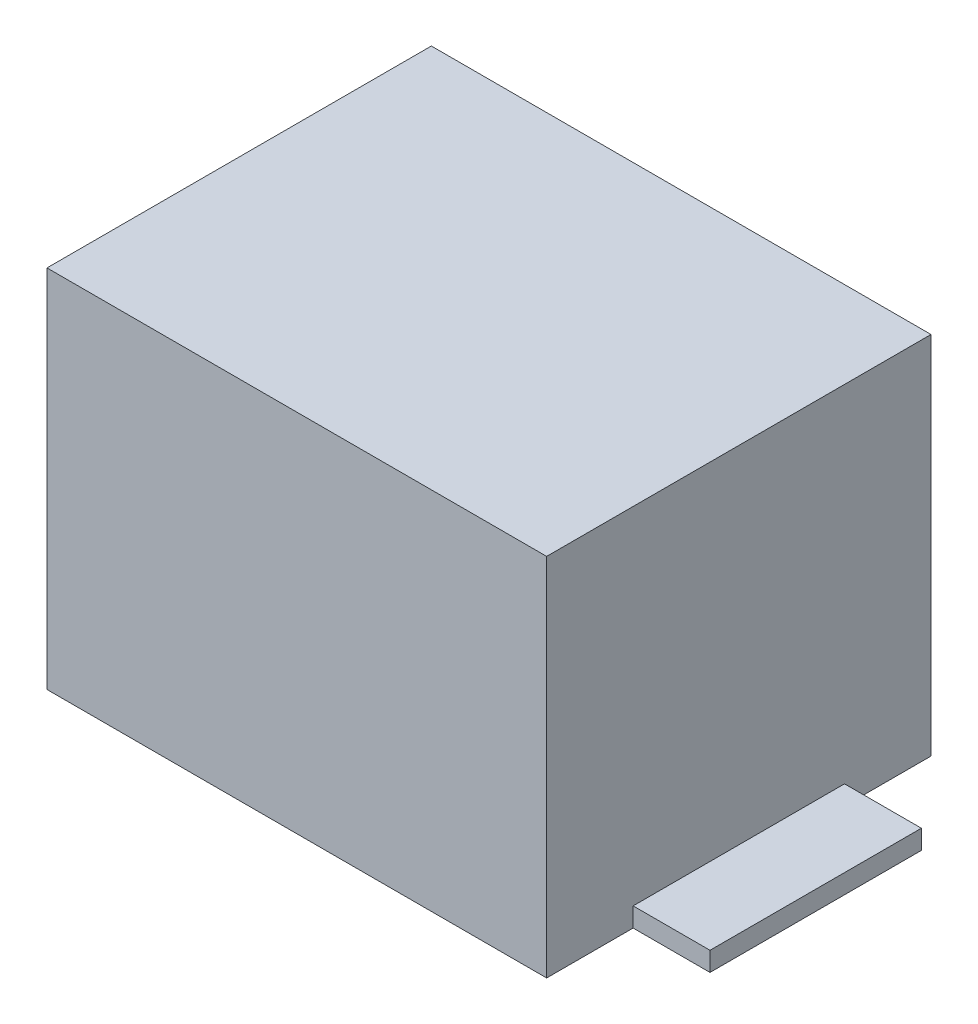
ISO-10303-21;
HEADER;
FILE_DESCRIPTION(('STEP AP214'),'2;1');
FILE_NAME('part.step','',(''),(''),'','','');
FILE_SCHEMA(('AUTOMOTIVE_DESIGN { 1 0 10303 214 1 1 1 1 }'));
ENDSEC;
DATA;
#1=APPLICATION_CONTEXT('core data for automotive mechanical design processes');
#2=APPLICATION_PROTOCOL_DEFINITION('international standard','automotive_design',2000,#1);
#3=PRODUCT_CONTEXT('',#1,'mechanical');
#4=PRODUCT('Part','Part','',(#3));
#5=PRODUCT_RELATED_PRODUCT_CATEGORY('part','',(#4));
#6=PRODUCT_DEFINITION_FORMATION('','',#4);
#7=PRODUCT_DEFINITION_CONTEXT('part definition',#1,'design');
#8=PRODUCT_DEFINITION('design','',#6,#7);
#9=PRODUCT_DEFINITION_SHAPE('','',#8);
#10=(LENGTH_UNIT() NAMED_UNIT(*) SI_UNIT(.MILLI.,.METRE.));
#11=(NAMED_UNIT(*) PLANE_ANGLE_UNIT() SI_UNIT($,.RADIAN.));
#12=(NAMED_UNIT(*) SI_UNIT($,.STERADIAN.) SOLID_ANGLE_UNIT());
#13=UNCERTAINTY_MEASURE_WITH_UNIT(LENGTH_MEASURE(1.E-05),#10,'distance_accuracy_value','');
#14=(GEOMETRIC_REPRESENTATION_CONTEXT(3) GLOBAL_UNCERTAINTY_ASSIGNED_CONTEXT((#13)) GLOBAL_UNIT_ASSIGNED_CONTEXT((#10,
#11,#12)) REPRESENTATION_CONTEXT('',''));
#15=CARTESIAN_POINT('',(0.,0.,0.));
#16=DIRECTION('',(0.,0.,1.));
#17=DIRECTION('',(1.,0.,0.));
#18=AXIS2_PLACEMENT_3D('',#15,#16,#17);
#19=CARTESIAN_POINT('',(13.,1.,5.5));
#20=DIRECTION('',(-1.,0.,0.));
#21=DIRECTION('',(0.,0.,1.));
#22=AXIS2_PLACEMENT_3D('',#19,#20,#21);
#23=PLANE('',#22);
#24=DIRECTION('',(0.,0.,-1.));
#25=VECTOR('',#24,1.);
#26=CARTESIAN_POINT('',(13.,0.,5.5));
#27=LINE('',#26,#25);
#28=CARTESIAN_POINT('',(13.,0.,5.5));
#29=VERTEX_POINT('',#28);
#30=CARTESIAN_POINT('',(13.,0.,-5.5));
#31=VERTEX_POINT('',#30);
#32=EDGE_CURVE('E110',#29,#31,#27,.T.);
#33=ORIENTED_EDGE('',*,*,#32,.F.);
#34=DIRECTION('',(0.,-1.,0.));
#35=VECTOR('',#34,1.);
#36=CARTESIAN_POINT('',(13.,1.,5.5));
#37=LINE('',#36,#35);
#38=CARTESIAN_POINT('',(13.,1.,5.5));
#39=VERTEX_POINT('',#38);
#40=EDGE_CURVE('E12',#39,#29,#37,.T.);
#41=ORIENTED_EDGE('',*,*,#40,.F.);
#42=DIRECTION('',(0.,0.,-1.));
#43=VECTOR('',#42,1.);
#44=CARTESIAN_POINT('',(13.,1.,5.5));
#45=LINE('',#44,#43);
#46=CARTESIAN_POINT('',(13.,1.,-5.5));
#47=VERTEX_POINT('',#46);
#48=EDGE_CURVE('E104',#39,#47,#45,.T.);
#49=ORIENTED_EDGE('',*,*,#48,.T.);
#50=DIRECTION('',(0.,-1.,0.));
#51=VECTOR('',#50,1.);
#52=CARTESIAN_POINT('',(13.,1.,-5.5));
#53=LINE('',#52,#51);
#54=EDGE_CURVE('E49',#47,#31,#53,.T.);
#55=ORIENTED_EDGE('',*,*,#54,.T.);
#56=EDGE_LOOP('',(#33,#41,#49,#55));
#57=FACE_BOUND('',#56,.T.);
#58=ADVANCED_FACE('F46',(#57),#23,.T.);
#59=CARTESIAN_POINT('',(13.,1.,5.5));
#60=DIRECTION('',(0.,0.,1.));
#61=DIRECTION('',(1.,0.,0.));
#62=AXIS2_PLACEMENT_3D('',#59,#60,#61);
#63=PLANE('',#62);
#64=DIRECTION('',(-1.,0.,0.));
#65=VECTOR('',#64,1.);
#66=CARTESIAN_POINT('',(13.,0.,5.5));
#67=LINE('',#66,#65);
#68=CARTESIAN_POINT('',(17.,0.,5.5));
#69=VERTEX_POINT('',#68);
#70=EDGE_CURVE('E106',#69,#29,#67,.T.);
#71=ORIENTED_EDGE('',*,*,#70,.F.);
#72=DIRECTION('',(0.,-1.,0.));
#73=VECTOR('',#72,1.);
#74=CARTESIAN_POINT('',(17.,1.,5.5));
#75=LINE('',#74,#73);
#76=CARTESIAN_POINT('',(17.,1.,5.5));
#77=VERTEX_POINT('',#76);
#78=EDGE_CURVE('E55',#77,#69,#75,.T.);
#79=ORIENTED_EDGE('',*,*,#78,.F.);
#80=DIRECTION('',(-1.,0.,0.));
#81=VECTOR('',#80,1.);
#82=CARTESIAN_POINT('',(13.,1.,5.5));
#83=LINE('',#82,#81);
#84=EDGE_CURVE('E101',#77,#39,#83,.T.);
#85=ORIENTED_EDGE('',*,*,#84,.T.);
#86=ORIENTED_EDGE('',*,*,#40,.T.);
#87=EDGE_LOOP('',(#71,#79,#85,#86));
#88=FACE_BOUND('',#87,.T.);
#89=ADVANCED_FACE('F120',(#88),#63,.T.);
#90=CARTESIAN_POINT('',(17.,1.,5.5));
#91=DIRECTION('',(1.,0.,0.));
#92=DIRECTION('',(0.,0.,-1.));
#93=AXIS2_PLACEMENT_3D('',#90,#91,#92);
#94=PLANE('',#93);
#95=DIRECTION('',(0.,0.,1.));
#96=VECTOR('',#95,1.);
#97=CARTESIAN_POINT('',(17.,0.,5.5));
#98=LINE('',#97,#96);
#99=CARTESIAN_POINT('',(17.,0.,-5.5));
#100=VERTEX_POINT('',#99);
#101=EDGE_CURVE('E96',#100,#69,#98,.T.);
#102=ORIENTED_EDGE('',*,*,#101,.F.);
#103=DIRECTION('',(0.,-1.,0.));
#104=VECTOR('',#103,1.);
#105=CARTESIAN_POINT('',(17.,1.,-5.5));
#106=LINE('',#105,#104);
#107=CARTESIAN_POINT('',(17.,1.,-5.5));
#108=VERTEX_POINT('',#107);
#109=EDGE_CURVE('E91',#108,#100,#106,.T.);
#110=ORIENTED_EDGE('',*,*,#109,.F.);
#111=DIRECTION('',(0.,0.,1.));
#112=VECTOR('',#111,1.);
#113=CARTESIAN_POINT('',(17.,1.,5.5));
#114=LINE('',#113,#112);
#115=EDGE_CURVE('E94',#108,#77,#114,.T.);
#116=ORIENTED_EDGE('',*,*,#115,.T.);
#117=ORIENTED_EDGE('',*,*,#78,.T.);
#118=EDGE_LOOP('',(#102,#110,#116,#117));
#119=FACE_BOUND('',#118,.T.);
#120=ADVANCED_FACE('F93',(#119),#94,.T.);
#121=CARTESIAN_POINT('',(13.,1.,-5.5));
#122=DIRECTION('',(0.,0.,-1.));
#123=DIRECTION('',(-1.,0.,0.));
#124=AXIS2_PLACEMENT_3D('',#121,#122,#123);
#125=PLANE('',#124);
#126=DIRECTION('',(1.,0.,0.));
#127=VECTOR('',#126,1.);
#128=CARTESIAN_POINT('',(13.,0.,-5.5));
#129=LINE('',#128,#127);
#130=EDGE_CURVE('E113',#31,#100,#129,.T.);
#131=ORIENTED_EDGE('',*,*,#130,.F.);
#132=ORIENTED_EDGE('',*,*,#54,.F.);
#133=DIRECTION('',(1.,0.,0.));
#134=VECTOR('',#133,1.);
#135=CARTESIAN_POINT('',(13.,1.,-5.5));
#136=LINE('',#135,#134);
#137=EDGE_CURVE('E100',#47,#108,#136,.T.);
#138=ORIENTED_EDGE('',*,*,#137,.T.);
#139=ORIENTED_EDGE('',*,*,#109,.T.);
#140=EDGE_LOOP('',(#131,#132,#138,#139));
#141=FACE_BOUND('',#140,.T.);
#142=ADVANCED_FACE('F103',(#141),#125,.T.);
#143=CARTESIAN_POINT('',(0.,1.,0.));
#144=DIRECTION('',(0.,-1.,0.));
#145=DIRECTION('',(0.,0.,-1.));
#146=AXIS2_PLACEMENT_3D('',#143,#144,#145);
#147=PLANE('',#146);
#148=ORIENTED_EDGE('',*,*,#48,.F.);
#149=ORIENTED_EDGE('',*,*,#84,.F.);
#150=ORIENTED_EDGE('',*,*,#115,.F.);
#151=ORIENTED_EDGE('',*,*,#137,.F.);
#152=EDGE_LOOP('',(#148,#149,#150,#151));
#153=FACE_BOUND('',#152,.T.);
#154=ADVANCED_FACE('F99',(#153),#147,.F.);
#155=CARTESIAN_POINT('',(0.,0.,0.));
#156=DIRECTION('',(0.,-1.,0.));
#157=DIRECTION('',(0.,0.,-1.));
#158=AXIS2_PLACEMENT_3D('',#155,#156,#157);
#159=PLANE('',#158);
#160=ORIENTED_EDGE('',*,*,#32,.T.);
#161=ORIENTED_EDGE('',*,*,#130,.T.);
#162=ORIENTED_EDGE('',*,*,#101,.T.);
#163=ORIENTED_EDGE('',*,*,#70,.T.);
#164=EDGE_LOOP('',(#160,#161,#162,#163));
#165=FACE_BOUND('',#164,.T.);
#166=ADVANCED_FACE('F119',(#165),#159,.T.);
#167=CLOSED_SHELL('',(#58,#89,#120,#142,#154,#166));
#168=MANIFOLD_SOLID_BREP('B2',#167);
#169=CARTESIAN_POINT('',(-17.,1.,5.5));
#170=DIRECTION('',(-1.,0.,0.));
#171=DIRECTION('',(0.,0.,1.));
#172=AXIS2_PLACEMENT_3D('',#169,#170,#171);
#173=PLANE('',#172);
#174=DIRECTION('',(0.,0.,-1.));
#175=VECTOR('',#174,1.);
#176=CARTESIAN_POINT('',(-17.,0.,5.5));
#177=LINE('',#176,#175);
#178=CARTESIAN_POINT('',(-17.,0.,5.5));
#179=VERTEX_POINT('',#178);
#180=CARTESIAN_POINT('',(-17.,0.,-5.5));
#181=VERTEX_POINT('',#180);
#182=EDGE_CURVE('E243',#179,#181,#177,.T.);
#183=ORIENTED_EDGE('',*,*,#182,.F.);
#184=DIRECTION('',(0.,-1.,0.));
#185=VECTOR('',#184,1.);
#186=CARTESIAN_POINT('',(-17.,1.,5.5));
#187=LINE('',#186,#185);
#188=CARTESIAN_POINT('',(-17.,1.,5.5));
#189=VERTEX_POINT('',#188);
#190=EDGE_CURVE('E44',#189,#179,#187,.T.);
#191=ORIENTED_EDGE('',*,*,#190,.F.);
#192=DIRECTION('',(0.,0.,-1.));
#193=VECTOR('',#192,1.);
#194=CARTESIAN_POINT('',(-17.,1.,5.5));
#195=LINE('',#194,#193);
#196=CARTESIAN_POINT('',(-17.,1.,-5.5));
#197=VERTEX_POINT('',#196);
#198=EDGE_CURVE('E237',#189,#197,#195,.T.);
#199=ORIENTED_EDGE('',*,*,#198,.T.);
#200=DIRECTION('',(0.,-1.,0.));
#201=VECTOR('',#200,1.);
#202=CARTESIAN_POINT('',(-17.,1.,-5.5));
#203=LINE('',#202,#201);
#204=EDGE_CURVE('E182',#197,#181,#203,.T.);
#205=ORIENTED_EDGE('',*,*,#204,.T.);
#206=EDGE_LOOP('',(#183,#191,#199,#205));
#207=FACE_BOUND('',#206,.T.);
#208=ADVANCED_FACE('F179',(#207),#173,.T.);
#209=CARTESIAN_POINT('',(-13.,1.,5.5));
#210=DIRECTION('',(0.,0.,1.));
#211=DIRECTION('',(1.,0.,0.));
#212=AXIS2_PLACEMENT_3D('',#209,#210,#211);
#213=PLANE('',#212);
#214=DIRECTION('',(-1.,0.,0.));
#215=VECTOR('',#214,1.);
#216=CARTESIAN_POINT('',(-13.,0.,5.5));
#217=LINE('',#216,#215);
#218=CARTESIAN_POINT('',(-13.,0.,5.5));
#219=VERTEX_POINT('',#218);
#220=EDGE_CURVE('E239',#219,#179,#217,.T.);
#221=ORIENTED_EDGE('',*,*,#220,.F.);
#222=DIRECTION('',(0.,-1.,0.));
#223=VECTOR('',#222,1.);
#224=CARTESIAN_POINT('',(-13.,1.,5.5));
#225=LINE('',#224,#223);
#226=CARTESIAN_POINT('',(-13.,1.,5.5));
#227=VERTEX_POINT('',#226);
#228=EDGE_CURVE('E188',#227,#219,#225,.T.);
#229=ORIENTED_EDGE('',*,*,#228,.F.);
#230=DIRECTION('',(-1.,0.,0.));
#231=VECTOR('',#230,1.);
#232=CARTESIAN_POINT('',(-13.,1.,5.5));
#233=LINE('',#232,#231);
#234=EDGE_CURVE('E234',#227,#189,#233,.T.);
#235=ORIENTED_EDGE('',*,*,#234,.T.);
#236=ORIENTED_EDGE('',*,*,#190,.T.);
#237=EDGE_LOOP('',(#221,#229,#235,#236));
#238=FACE_BOUND('',#237,.T.);
#239=ADVANCED_FACE('F253',(#238),#213,.T.);
#240=CARTESIAN_POINT('',(-13.,1.,5.5));
#241=DIRECTION('',(1.,0.,0.));
#242=DIRECTION('',(0.,0.,-1.));
#243=AXIS2_PLACEMENT_3D('',#240,#241,#242);
#244=PLANE('',#243);
#245=DIRECTION('',(0.,0.,1.));
#246=VECTOR('',#245,1.);
#247=CARTESIAN_POINT('',(-13.,0.,5.5));
#248=LINE('',#247,#246);
#249=CARTESIAN_POINT('',(-13.,0.,-5.5));
#250=VERTEX_POINT('',#249);
#251=EDGE_CURVE('E229',#250,#219,#248,.T.);
#252=ORIENTED_EDGE('',*,*,#251,.F.);
#253=DIRECTION('',(0.,-1.,0.));
#254=VECTOR('',#253,1.);
#255=CARTESIAN_POINT('',(-13.,1.,-5.5));
#256=LINE('',#255,#254);
#257=CARTESIAN_POINT('',(-13.,1.,-5.5));
#258=VERTEX_POINT('',#257);
#259=EDGE_CURVE('E224',#258,#250,#256,.T.);
#260=ORIENTED_EDGE('',*,*,#259,.F.);
#261=DIRECTION('',(0.,0.,1.));
#262=VECTOR('',#261,1.);
#263=CARTESIAN_POINT('',(-13.,1.,5.5));
#264=LINE('',#263,#262);
#265=EDGE_CURVE('E227',#258,#227,#264,.T.);
#266=ORIENTED_EDGE('',*,*,#265,.T.);
#267=ORIENTED_EDGE('',*,*,#228,.T.);
#268=EDGE_LOOP('',(#252,#260,#266,#267));
#269=FACE_BOUND('',#268,.T.);
#270=ADVANCED_FACE('F226',(#269),#244,.T.);
#271=CARTESIAN_POINT('',(-13.,1.,-5.5));
#272=DIRECTION('',(0.,0.,-1.));
#273=DIRECTION('',(-1.,0.,0.));
#274=AXIS2_PLACEMENT_3D('',#271,#272,#273);
#275=PLANE('',#274);
#276=DIRECTION('',(1.,0.,0.));
#277=VECTOR('',#276,1.);
#278=CARTESIAN_POINT('',(-13.,0.,-5.5));
#279=LINE('',#278,#277);
#280=EDGE_CURVE('E246',#181,#250,#279,.T.);
#281=ORIENTED_EDGE('',*,*,#280,.F.);
#282=ORIENTED_EDGE('',*,*,#204,.F.);
#283=DIRECTION('',(1.,0.,0.));
#284=VECTOR('',#283,1.);
#285=CARTESIAN_POINT('',(-13.,1.,-5.5));
#286=LINE('',#285,#284);
#287=EDGE_CURVE('E233',#197,#258,#286,.T.);
#288=ORIENTED_EDGE('',*,*,#287,.T.);
#289=ORIENTED_EDGE('',*,*,#259,.T.);
#290=EDGE_LOOP('',(#281,#282,#288,#289));
#291=FACE_BOUND('',#290,.T.);
#292=ADVANCED_FACE('F236',(#291),#275,.T.);
#293=CARTESIAN_POINT('',(0.,1.,0.));
#294=DIRECTION('',(0.,1.,0.));
#295=DIRECTION('',(0.,0.,1.));
#296=AXIS2_PLACEMENT_3D('',#293,#294,#295);
#297=PLANE('',#296);
#298=ORIENTED_EDGE('',*,*,#198,.F.);
#299=ORIENTED_EDGE('',*,*,#234,.F.);
#300=ORIENTED_EDGE('',*,*,#265,.F.);
#301=ORIENTED_EDGE('',*,*,#287,.F.);
#302=EDGE_LOOP('',(#298,#299,#300,#301));
#303=FACE_BOUND('',#302,.T.);
#304=ADVANCED_FACE('F232',(#303),#297,.T.);
#305=CARTESIAN_POINT('',(0.,0.,0.));
#306=DIRECTION('',(0.,1.,0.));
#307=DIRECTION('',(0.,0.,1.));
#308=AXIS2_PLACEMENT_3D('',#305,#306,#307);
#309=PLANE('',#308);
#310=ORIENTED_EDGE('',*,*,#182,.T.);
#311=ORIENTED_EDGE('',*,*,#280,.T.);
#312=ORIENTED_EDGE('',*,*,#251,.T.);
#313=ORIENTED_EDGE('',*,*,#220,.T.);
#314=EDGE_LOOP('',(#310,#311,#312,#313));
#315=FACE_BOUND('',#314,.T.);
#316=ADVANCED_FACE('F252',(#315),#309,.F.);
#317=CLOSED_SHELL('',(#208,#239,#270,#292,#304,#316));
#318=MANIFOLD_SOLID_BREP('B6',#317);
#319=CARTESIAN_POINT('',(13.,19.,-10.));
#320=DIRECTION('',(-1.,0.,0.));
#321=DIRECTION('',(0.,0.,1.));
#322=AXIS2_PLACEMENT_3D('',#319,#320,#321);
#323=PLANE('',#322);
#324=DIRECTION('',(0.,0.,-1.));
#325=VECTOR('',#324,1.);
#326=CARTESIAN_POINT('',(13.,0.,-10.));
#327=LINE('',#326,#325);
#328=CARTESIAN_POINT('',(13.,0.,10.));
#329=VERTEX_POINT('',#328);
#330=CARTESIAN_POINT('',(13.,0.,-10.));
#331=VERTEX_POINT('',#330);
#332=EDGE_CURVE('E366',#329,#331,#327,.T.);
#333=ORIENTED_EDGE('',*,*,#332,.T.);
#334=DIRECTION('',(0.,-1.,0.));
#335=VECTOR('',#334,1.);
#336=CARTESIAN_POINT('',(13.,19.,-10.));
#337=LINE('',#336,#335);
#338=CARTESIAN_POINT('',(13.,19.,-10.));
#339=VERTEX_POINT('',#338);
#340=EDGE_CURVE('E177',#339,#331,#337,.T.);
#341=ORIENTED_EDGE('',*,*,#340,.F.);
#342=DIRECTION('',(0.,0.,-1.));
#343=VECTOR('',#342,1.);
#344=CARTESIAN_POINT('',(13.,19.,-10.));
#345=LINE('',#344,#343);
#346=CARTESIAN_POINT('',(13.,19.,10.));
#347=VERTEX_POINT('',#346);
#348=EDGE_CURVE('E354',#347,#339,#345,.T.);
#349=ORIENTED_EDGE('',*,*,#348,.F.);
#350=DIRECTION('',(0.,-1.,0.));
#351=VECTOR('',#350,1.);
#352=CARTESIAN_POINT('',(13.,19.,10.));
#353=LINE('',#352,#351);
#354=EDGE_CURVE('E362',#347,#329,#353,.T.);
#355=ORIENTED_EDGE('',*,*,#354,.T.);
#356=EDGE_LOOP('',(#333,#341,#349,#355));
#357=FACE_BOUND('',#356,.T.);
#358=ADVANCED_FACE('F303',(#357),#323,.F.);
#359=CARTESIAN_POINT('',(-13.,19.,-10.));
#360=DIRECTION('',(0.,0.,1.));
#361=DIRECTION('',(1.,0.,0.));
#362=AXIS2_PLACEMENT_3D('',#359,#360,#361);
#363=PLANE('',#362);
#364=DIRECTION('',(-1.,0.,0.));
#365=VECTOR('',#364,1.);
#366=CARTESIAN_POINT('',(-13.,0.,-10.));
#367=LINE('',#366,#365);
#368=CARTESIAN_POINT('',(-13.,0.,-10.));
#369=VERTEX_POINT('',#368);
#370=EDGE_CURVE('E358',#331,#369,#367,.T.);
#371=ORIENTED_EDGE('',*,*,#370,.T.);
#372=DIRECTION('',(0.,-1.,0.));
#373=VECTOR('',#372,1.);
#374=CARTESIAN_POINT('',(-13.,19.,-10.));
#375=LINE('',#374,#373);
#376=CARTESIAN_POINT('',(-13.,19.,-10.));
#377=VERTEX_POINT('',#376);
#378=EDGE_CURVE('E311',#377,#369,#375,.T.);
#379=ORIENTED_EDGE('',*,*,#378,.F.);
#380=DIRECTION('',(-1.,0.,0.));
#381=VECTOR('',#380,1.);
#382=CARTESIAN_POINT('',(-13.,19.,-10.));
#383=LINE('',#382,#381);
#384=EDGE_CURVE('E349',#339,#377,#383,.T.);
#385=ORIENTED_EDGE('',*,*,#384,.F.);
#386=ORIENTED_EDGE('',*,*,#340,.T.);
#387=EDGE_LOOP('',(#371,#379,#385,#386));
#388=FACE_BOUND('',#387,.T.);
#389=ADVANCED_FACE('F357',(#388),#363,.F.);
#390=CARTESIAN_POINT('',(-13.,19.,-10.));
#391=DIRECTION('',(1.,0.,0.));
#392=DIRECTION('',(0.,0.,-1.));
#393=AXIS2_PLACEMENT_3D('',#390,#391,#392);
#394=PLANE('',#393);
#395=DIRECTION('',(0.,0.,1.));
#396=VECTOR('',#395,1.);
#397=CARTESIAN_POINT('',(-13.,0.,-10.));
#398=LINE('',#397,#396);
#399=CARTESIAN_POINT('',(-13.,0.,10.));
#400=VERTEX_POINT('',#399);
#401=EDGE_CURVE('E336',#369,#400,#398,.T.);
#402=ORIENTED_EDGE('',*,*,#401,.T.);
#403=DIRECTION('',(0.,-1.,0.));
#404=VECTOR('',#403,1.);
#405=CARTESIAN_POINT('',(-13.,19.,10.));
#406=LINE('',#405,#404);
#407=CARTESIAN_POINT('',(-13.,19.,10.));
#408=VERTEX_POINT('',#407);
#409=EDGE_CURVE('E359',#408,#400,#406,.T.);
#410=ORIENTED_EDGE('',*,*,#409,.F.);
#411=DIRECTION('',(0.,0.,1.));
#412=VECTOR('',#411,1.);
#413=CARTESIAN_POINT('',(-13.,19.,-10.));
#414=LINE('',#413,#412);
#415=EDGE_CURVE('E352',#377,#408,#414,.T.);
#416=ORIENTED_EDGE('',*,*,#415,.F.);
#417=ORIENTED_EDGE('',*,*,#378,.T.);
#418=EDGE_LOOP('',(#402,#410,#416,#417));
#419=FACE_BOUND('',#418,.T.);
#420=ADVANCED_FACE('F360',(#419),#394,.F.);
#421=CARTESIAN_POINT('',(-13.,19.,10.));
#422=DIRECTION('',(0.,0.,-1.));
#423=DIRECTION('',(-1.,0.,0.));
#424=AXIS2_PLACEMENT_3D('',#421,#422,#423);
#425=PLANE('',#424);
#426=DIRECTION('',(1.,0.,0.));
#427=VECTOR('',#426,1.);
#428=CARTESIAN_POINT('',(-13.,0.,10.));
#429=LINE('',#428,#427);
#430=EDGE_CURVE('E342',#400,#329,#429,.T.);
#431=ORIENTED_EDGE('',*,*,#430,.T.);
#432=ORIENTED_EDGE('',*,*,#354,.F.);
#433=DIRECTION('',(1.,0.,0.));
#434=VECTOR('',#433,1.);
#435=CARTESIAN_POINT('',(-13.,19.,10.));
#436=LINE('',#435,#434);
#437=EDGE_CURVE('E319',#408,#347,#436,.T.);
#438=ORIENTED_EDGE('',*,*,#437,.F.);
#439=ORIENTED_EDGE('',*,*,#409,.T.);
#440=EDGE_LOOP('',(#431,#432,#438,#439));
#441=FACE_BOUND('',#440,.T.);
#442=ADVANCED_FACE('F373',(#441),#425,.F.);
#443=CARTESIAN_POINT('',(0.,19.,0.));
#444=DIRECTION('',(0.,1.,0.));
#445=DIRECTION('',(0.,0.,1.));
#446=AXIS2_PLACEMENT_3D('',#443,#444,#445);
#447=PLANE('',#446);
#448=ORIENTED_EDGE('',*,*,#348,.T.);
#449=ORIENTED_EDGE('',*,*,#384,.T.);
#450=ORIENTED_EDGE('',*,*,#415,.T.);
#451=ORIENTED_EDGE('',*,*,#437,.T.);
#452=EDGE_LOOP('',(#448,#449,#450,#451));
#453=FACE_BOUND('',#452,.T.);
#454=ADVANCED_FACE('F350',(#453),#447,.T.);
#455=CARTESIAN_POINT('',(0.,0.,0.));
#456=DIRECTION('',(0.,1.,0.));
#457=DIRECTION('',(0.,0.,1.));
#458=AXIS2_PLACEMENT_3D('',#455,#456,#457);
#459=PLANE('',#458);
#460=ORIENTED_EDGE('',*,*,#332,.F.);
#461=ORIENTED_EDGE('',*,*,#430,.F.);
#462=ORIENTED_EDGE('',*,*,#401,.F.);
#463=ORIENTED_EDGE('',*,*,#370,.F.);
#464=EDGE_LOOP('',(#460,#461,#462,#463));
#465=FACE_BOUND('',#464,.T.);
#466=ADVANCED_FACE('F376',(#465),#459,.F.);
#467=CLOSED_SHELL('',(#358,#389,#420,#442,#454,#466));
#468=MANIFOLD_SOLID_BREP('B38',#467);
#469=ADVANCED_BREP_SHAPE_REPRESENTATION('',(#18,#168,#318,#468),#14);
#470=SHAPE_DEFINITION_REPRESENTATION(#9,#469);
ENDSEC;
END-ISO-10303-21;
